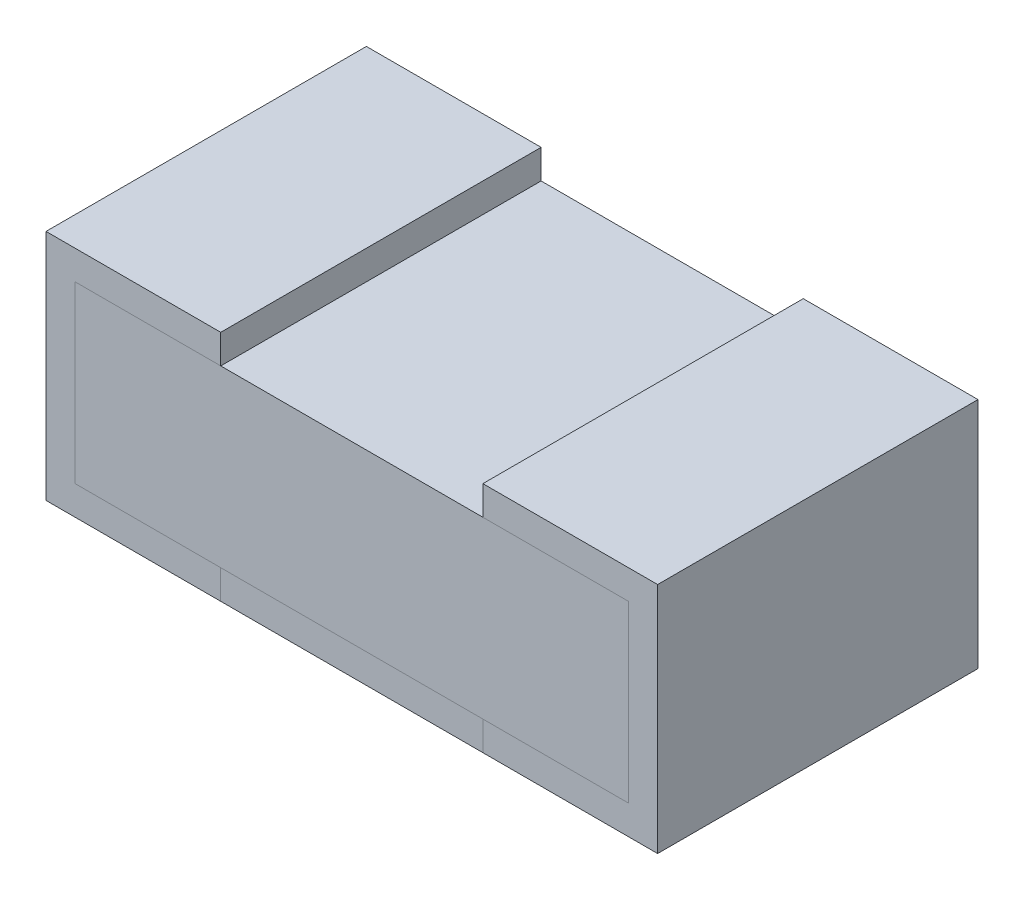
ISO-10303-21;
HEADER;
FILE_DESCRIPTION(('STEP AP214'),'2;1');
FILE_NAME('part.step','',(''),(''),'','','');
FILE_SCHEMA(('AUTOMOTIVE_DESIGN { 1 0 10303 214 1 1 1 1 }'));
ENDSEC;
DATA;
#1=APPLICATION_CONTEXT('core data for automotive mechanical design processes');
#2=APPLICATION_PROTOCOL_DEFINITION('international standard','automotive_design',2000,#1);
#3=PRODUCT_CONTEXT('',#1,'mechanical');
#4=PRODUCT('Part','Part','',(#3));
#5=PRODUCT_RELATED_PRODUCT_CATEGORY('part','',(#4));
#6=PRODUCT_DEFINITION_FORMATION('','',#4);
#7=PRODUCT_DEFINITION_CONTEXT('part definition',#1,'design');
#8=PRODUCT_DEFINITION('design','',#6,#7);
#9=PRODUCT_DEFINITION_SHAPE('','',#8);
#10=(LENGTH_UNIT() NAMED_UNIT(*) SI_UNIT(.MILLI.,.METRE.));
#11=(NAMED_UNIT(*) PLANE_ANGLE_UNIT() SI_UNIT($,.RADIAN.));
#12=(NAMED_UNIT(*) SI_UNIT($,.STERADIAN.) SOLID_ANGLE_UNIT());
#13=UNCERTAINTY_MEASURE_WITH_UNIT(LENGTH_MEASURE(1.E-05),#10,'distance_accuracy_value','');
#14=(GEOMETRIC_REPRESENTATION_CONTEXT(3) GLOBAL_UNCERTAINTY_ASSIGNED_CONTEXT((#13)) GLOBAL_UNIT_ASSIGNED_CONTEXT((#10,
#11,#12)) REPRESENTATION_CONTEXT('',''));
#15=CARTESIAN_POINT('',(0.,0.,0.));
#16=DIRECTION('',(0.,0.,1.));
#17=DIRECTION('',(1.,0.,0.));
#18=AXIS2_PLACEMENT_3D('',#15,#16,#17);
#19=CARTESIAN_POINT('',(0.749999999953739,0.,1.375));
#20=DIRECTION('',(-1.,0.,0.));
#21=DIRECTION('',(0.,0.,1.));
#22=AXIS2_PLACEMENT_3D('',#19,#20,#21);
#23=PLANE('',#22);
#24=DIRECTION('',(0.,1.,0.));
#25=VECTOR('',#24,1.);
#26=CARTESIAN_POINT('',(0.749999999953739,0.,0.));
#27=LINE('',#26,#25);
#28=CARTESIAN_POINT('',(0.749999999953739,0.,0.));
#29=VERTEX_POINT('',#28);
#30=CARTESIAN_POINT('',(0.749999999953739,0.124999999968622,0.));
#31=VERTEX_POINT('',#30);
#32=EDGE_CURVE('E145',#29,#31,#27,.T.);
#33=ORIENTED_EDGE('',*,*,#32,.T.);
#34=DIRECTION('',(0.,0.,-1.));
#35=VECTOR('',#34,1.);
#36=CARTESIAN_POINT('',(0.749999999953739,0.124999999968622,1.375));
#37=LINE('',#36,#35);
#38=CARTESIAN_POINT('',(0.749999999953739,0.124999999968622,1.375));
#39=VERTEX_POINT('',#38);
#40=EDGE_CURVE('E12',#39,#31,#37,.T.);
#41=ORIENTED_EDGE('',*,*,#40,.F.);
#42=DIRECTION('',(0.,1.,0.));
#43=VECTOR('',#42,1.);
#44=CARTESIAN_POINT('',(0.749999999953739,0.,1.375));
#45=LINE('',#44,#43);
#46=CARTESIAN_POINT('',(0.749999999953739,0.,1.375));
#47=VERTEX_POINT('',#46);
#48=EDGE_CURVE('E159',#47,#39,#45,.T.);
#49=ORIENTED_EDGE('',*,*,#48,.F.);
#50=DIRECTION('',(0.,0.,-1.));
#51=VECTOR('',#50,1.);
#52=CARTESIAN_POINT('',(0.749999999953739,0.,1.375));
#53=LINE('',#52,#51);
#54=EDGE_CURVE('E141',#47,#29,#53,.T.);
#55=ORIENTED_EDGE('',*,*,#54,.T.);
#56=EDGE_LOOP('',(#33,#41,#49,#55));
#57=FACE_BOUND('',#56,.T.);
#58=ADVANCED_FACE('F49',(#57),#23,.F.);
#59=CARTESIAN_POINT('',(0.749999999953739,0.124999999968622,1.375));
#60=DIRECTION('',(0.,-1.,0.));
#61=DIRECTION('',(0.,0.,-1.));
#62=AXIS2_PLACEMENT_3D('',#59,#60,#61);
#63=PLANE('',#62);
#64=DIRECTION('',(-1.,0.,0.));
#65=VECTOR('',#64,1.);
#66=CARTESIAN_POINT('',(0.749999999953739,0.124999999968622,0.));
#67=LINE('',#66,#65);
#68=CARTESIAN_POINT('',(0.124999999968484,0.124999999968622,0.));
#69=VERTEX_POINT('',#68);
#70=EDGE_CURVE('E148',#31,#69,#67,.T.);
#71=ORIENTED_EDGE('',*,*,#70,.T.);
#72=DIRECTION('',(0.,0.,-1.));
#73=VECTOR('',#72,1.);
#74=CARTESIAN_POINT('',(0.124999999968484,0.124999999968622,1.375));
#75=LINE('',#74,#73);
#76=CARTESIAN_POINT('',(0.124999999968484,0.124999999968622,1.375));
#77=VERTEX_POINT('',#76);
#78=EDGE_CURVE('E57',#77,#69,#75,.T.);
#79=ORIENTED_EDGE('',*,*,#78,.F.);
#80=DIRECTION('',(-1.,0.,0.));
#81=VECTOR('',#80,1.);
#82=CARTESIAN_POINT('',(0.749999999953739,0.124999999968622,1.375));
#83=LINE('',#82,#81);
#84=EDGE_CURVE('E108',#39,#77,#83,.T.);
#85=ORIENTED_EDGE('',*,*,#84,.F.);
#86=ORIENTED_EDGE('',*,*,#40,.T.);
#87=EDGE_LOOP('',(#71,#79,#85,#86));
#88=FACE_BOUND('',#87,.T.);
#89=ADVANCED_FACE('F194',(#88),#63,.F.);
#90=CARTESIAN_POINT('',(0.124999999968484,0.124999999968622,1.375));
#91=DIRECTION('',(-1.,0.,0.));
#92=DIRECTION('',(0.,0.,1.));
#93=AXIS2_PLACEMENT_3D('',#90,#91,#92);
#94=PLANE('',#93);
#95=DIRECTION('',(0.,1.,0.));
#96=VECTOR('',#95,1.);
#97=CARTESIAN_POINT('',(0.124999999968484,0.124999999968622,0.));
#98=LINE('',#97,#96);
#99=CARTESIAN_POINT('',(0.124999999968484,0.875000000098263,0.));
#100=VERTEX_POINT('',#99);
#101=EDGE_CURVE('E150',#69,#100,#98,.T.);
#102=ORIENTED_EDGE('',*,*,#101,.T.);
#103=DIRECTION('',(0.,0.,-1.));
#104=VECTOR('',#103,1.);
#105=CARTESIAN_POINT('',(0.124999999968484,0.875000000098263,1.375));
#106=LINE('',#105,#104);
#107=CARTESIAN_POINT('',(0.124999999968484,0.875000000098263,1.375));
#108=VERTEX_POINT('',#107);
#109=EDGE_CURVE('E166',#108,#100,#106,.T.);
#110=ORIENTED_EDGE('',*,*,#109,.F.);
#111=DIRECTION('',(0.,1.,0.));
#112=VECTOR('',#111,1.);
#113=CARTESIAN_POINT('',(0.124999999968484,0.124999999968622,1.375));
#114=LINE('',#113,#112);
#115=EDGE_CURVE('E174',#77,#108,#114,.T.);
#116=ORIENTED_EDGE('',*,*,#115,.F.);
#117=ORIENTED_EDGE('',*,*,#78,.T.);
#118=EDGE_LOOP('',(#102,#110,#116,#117));
#119=FACE_BOUND('',#118,.T.);
#120=ADVANCED_FACE('F172',(#119),#94,.F.);
#121=CARTESIAN_POINT('',(0.124999999968484,0.875000000098263,1.375));
#122=DIRECTION('',(0.,1.,0.));
#123=DIRECTION('',(0.,0.,1.));
#124=AXIS2_PLACEMENT_3D('',#121,#122,#123);
#125=PLANE('',#124);
#126=DIRECTION('',(1.,0.,0.));
#127=VECTOR('',#126,1.);
#128=CARTESIAN_POINT('',(0.124999999968484,0.875000000098263,0.));
#129=LINE('',#128,#127);
#130=CARTESIAN_POINT('',(0.749999999953739,0.875000000098263,0.));
#131=VERTEX_POINT('',#130);
#132=EDGE_CURVE('E152',#100,#131,#129,.T.);
#133=ORIENTED_EDGE('',*,*,#132,.T.);
#134=DIRECTION('',(0.,0.,-1.));
#135=VECTOR('',#134,1.);
#136=CARTESIAN_POINT('',(0.749999999953739,0.875000000098263,1.375));
#137=LINE('',#136,#135);
#138=CARTESIAN_POINT('',(0.749999999953739,0.875000000098263,1.375));
#139=VERTEX_POINT('',#138);
#140=EDGE_CURVE('E163',#139,#131,#137,.T.);
#141=ORIENTED_EDGE('',*,*,#140,.F.);
#142=DIRECTION('',(1.,0.,0.));
#143=VECTOR('',#142,1.);
#144=CARTESIAN_POINT('',(0.124999999968484,0.875000000098263,1.375));
#145=LINE('',#144,#143);
#146=EDGE_CURVE('E186',#108,#139,#145,.T.);
#147=ORIENTED_EDGE('',*,*,#146,.F.);
#148=ORIENTED_EDGE('',*,*,#109,.T.);
#149=EDGE_LOOP('',(#133,#141,#147,#148));
#150=FACE_BOUND('',#149,.T.);
#151=ADVANCED_FACE('F182',(#150),#125,.F.);
#152=CARTESIAN_POINT('',(0.749999999953739,0.875000000098263,1.375));
#153=DIRECTION('',(-1.,0.,0.));
#154=DIRECTION('',(0.,0.,1.));
#155=AXIS2_PLACEMENT_3D('',#152,#153,#154);
#156=PLANE('',#155);
#157=DIRECTION('',(0.,1.,0.));
#158=VECTOR('',#157,1.);
#159=CARTESIAN_POINT('',(0.749999999953739,0.875000000098263,0.));
#160=LINE('',#159,#158);
#161=CARTESIAN_POINT('',(0.749999999953739,1.0000000000332,0.));
#162=VERTEX_POINT('',#161);
#163=EDGE_CURVE('E154',#131,#162,#160,.T.);
#164=ORIENTED_EDGE('',*,*,#163,.T.);
#165=DIRECTION('',(0.,0.,-1.));
#166=VECTOR('',#165,1.);
#167=CARTESIAN_POINT('',(0.749999999953739,1.0000000000332,1.375));
#168=LINE('',#167,#166);
#169=CARTESIAN_POINT('',(0.749999999953739,1.0000000000332,1.375));
#170=VERTEX_POINT('',#169);
#171=EDGE_CURVE('E136',#170,#162,#168,.T.);
#172=ORIENTED_EDGE('',*,*,#171,.F.);
#173=DIRECTION('',(0.,1.,0.));
#174=VECTOR('',#173,1.);
#175=CARTESIAN_POINT('',(0.749999999953739,0.875000000098263,1.375));
#176=LINE('',#175,#174);
#177=EDGE_CURVE('E127',#139,#170,#176,.T.);
#178=ORIENTED_EDGE('',*,*,#177,.F.);
#179=ORIENTED_EDGE('',*,*,#140,.T.);
#180=EDGE_LOOP('',(#164,#172,#178,#179));
#181=FACE_BOUND('',#180,.T.);
#182=ADVANCED_FACE('F185',(#181),#156,.F.);
#183=CARTESIAN_POINT('',(0.749999999953739,1.0000000000332,1.375));
#184=DIRECTION('',(0.,-1.,0.));
#185=DIRECTION('',(0.,0.,-1.));
#186=AXIS2_PLACEMENT_3D('',#183,#184,#185);
#187=PLANE('',#186);
#188=DIRECTION('',(-1.,0.,0.));
#189=VECTOR('',#188,1.);
#190=CARTESIAN_POINT('',(0.749999999953739,1.0000000000332,0.));
#191=LINE('',#190,#189);
#192=CARTESIAN_POINT('',(0.,1.0000000000332,0.));
#193=VERTEX_POINT('',#192);
#194=EDGE_CURVE('E135',#162,#193,#191,.T.);
#195=ORIENTED_EDGE('',*,*,#194,.T.);
#196=DIRECTION('',(0.,0.,-1.));
#197=VECTOR('',#196,1.);
#198=CARTESIAN_POINT('',(0.,1.0000000000332,1.375));
#199=LINE('',#198,#197);
#200=CARTESIAN_POINT('',(0.,1.0000000000332,1.375));
#201=VERTEX_POINT('',#200);
#202=EDGE_CURVE('E132',#201,#193,#199,.T.);
#203=ORIENTED_EDGE('',*,*,#202,.F.);
#204=DIRECTION('',(-1.,0.,0.));
#205=VECTOR('',#204,1.);
#206=CARTESIAN_POINT('',(0.749999999953739,1.0000000000332,1.375));
#207=LINE('',#206,#205);
#208=EDGE_CURVE('E121',#170,#201,#207,.T.);
#209=ORIENTED_EDGE('',*,*,#208,.F.);
#210=ORIENTED_EDGE('',*,*,#171,.T.);
#211=EDGE_LOOP('',(#195,#203,#209,#210));
#212=FACE_BOUND('',#211,.T.);
#213=ADVANCED_FACE('F133',(#212),#187,.F.);
#214=CARTESIAN_POINT('',(0.,1.0000000000332,1.375));
#215=DIRECTION('',(1.,0.,0.));
#216=DIRECTION('',(0.,0.,-1.));
#217=AXIS2_PLACEMENT_3D('',#214,#215,#216);
#218=PLANE('',#217);
#219=DIRECTION('',(0.,-1.,0.));
#220=VECTOR('',#219,1.);
#221=CARTESIAN_POINT('',(0.,1.0000000000332,0.));
#222=LINE('',#221,#220);
#223=CARTESIAN_POINT('',(0.,0.,0.));
#224=VERTEX_POINT('',#223);
#225=EDGE_CURVE('E94',#193,#224,#222,.T.);
#226=ORIENTED_EDGE('',*,*,#225,.T.);
#227=DIRECTION('',(0.,0.,-1.));
#228=VECTOR('',#227,1.);
#229=CARTESIAN_POINT('',(0.,0.,1.375));
#230=LINE('',#229,#228);
#231=CARTESIAN_POINT('',(0.,0.,1.375));
#232=VERTEX_POINT('',#231);
#233=EDGE_CURVE('E137',#232,#224,#230,.T.);
#234=ORIENTED_EDGE('',*,*,#233,.F.);
#235=DIRECTION('',(0.,-1.,0.));
#236=VECTOR('',#235,1.);
#237=CARTESIAN_POINT('',(0.,1.0000000000332,1.375));
#238=LINE('',#237,#236);
#239=EDGE_CURVE('E125',#201,#232,#238,.T.);
#240=ORIENTED_EDGE('',*,*,#239,.F.);
#241=ORIENTED_EDGE('',*,*,#202,.T.);
#242=EDGE_LOOP('',(#226,#234,#240,#241));
#243=FACE_BOUND('',#242,.T.);
#244=ADVANCED_FACE('F139',(#243),#218,.F.);
#245=CARTESIAN_POINT('',(0.,0.,1.375));
#246=DIRECTION('',(0.,1.,0.));
#247=DIRECTION('',(0.,0.,1.));
#248=AXIS2_PLACEMENT_3D('',#245,#246,#247);
#249=PLANE('',#248);
#250=DIRECTION('',(1.,0.,0.));
#251=VECTOR('',#250,1.);
#252=CARTESIAN_POINT('',(0.,0.,0.));
#253=LINE('',#252,#251);
#254=EDGE_CURVE('E100',#224,#29,#253,.T.);
#255=ORIENTED_EDGE('',*,*,#254,.T.);
#256=ORIENTED_EDGE('',*,*,#54,.F.);
#257=DIRECTION('',(1.,0.,0.));
#258=VECTOR('',#257,1.);
#259=CARTESIAN_POINT('',(0.,0.,1.375));
#260=LINE('',#259,#258);
#261=EDGE_CURVE('E65',#232,#47,#260,.T.);
#262=ORIENTED_EDGE('',*,*,#261,.F.);
#263=ORIENTED_EDGE('',*,*,#233,.T.);
#264=EDGE_LOOP('',(#255,#256,#262,#263));
#265=FACE_BOUND('',#264,.T.);
#266=ADVANCED_FACE('F210',(#265),#249,.F.);
#267=CARTESIAN_POINT('',(0.,0.,1.375));
#268=DIRECTION('',(0.,0.,1.));
#269=DIRECTION('',(1.,0.,0.));
#270=AXIS2_PLACEMENT_3D('',#267,#268,#269);
#271=PLANE('',#270);
#272=ORIENTED_EDGE('',*,*,#48,.T.);
#273=ORIENTED_EDGE('',*,*,#84,.T.);
#274=ORIENTED_EDGE('',*,*,#115,.T.);
#275=ORIENTED_EDGE('',*,*,#146,.T.);
#276=ORIENTED_EDGE('',*,*,#177,.T.);
#277=ORIENTED_EDGE('',*,*,#208,.T.);
#278=ORIENTED_EDGE('',*,*,#239,.T.);
#279=ORIENTED_EDGE('',*,*,#261,.T.);
#280=EDGE_LOOP('',(#272,#273,#274,#275,#276,#277,#278,#279));
#281=FACE_BOUND('',#280,.T.);
#282=ADVANCED_FACE('F123',(#281),#271,.T.);
#283=CARTESIAN_POINT('',(0.,0.,0.));
#284=DIRECTION('',(0.,0.,1.));
#285=DIRECTION('',(1.,0.,0.));
#286=AXIS2_PLACEMENT_3D('',#283,#284,#285);
#287=PLANE('',#286);
#288=ORIENTED_EDGE('',*,*,#32,.F.);
#289=ORIENTED_EDGE('',*,*,#254,.F.);
#290=ORIENTED_EDGE('',*,*,#225,.F.);
#291=ORIENTED_EDGE('',*,*,#194,.F.);
#292=ORIENTED_EDGE('',*,*,#163,.F.);
#293=ORIENTED_EDGE('',*,*,#132,.F.);
#294=ORIENTED_EDGE('',*,*,#101,.F.);
#295=ORIENTED_EDGE('',*,*,#70,.F.);
#296=EDGE_LOOP('',(#288,#289,#290,#291,#292,#293,#294,#295));
#297=FACE_BOUND('',#296,.T.);
#298=ADVANCED_FACE('F178',(#297),#287,.F.);
#299=CLOSED_SHELL('',(#58,#89,#120,#151,#182,#213,#244,#266,#282,#298));
#300=MANIFOLD_SOLID_BREP('B2',#299);
#301=CARTESIAN_POINT('',(1.87499999995575,0.124999999968622,0.));
#302=DIRECTION('',(1.,0.,0.));
#303=DIRECTION('',(0.,0.,-1.));
#304=AXIS2_PLACEMENT_3D('',#301,#302,#303);
#305=PLANE('',#304);
#306=DIRECTION('',(0.,1.,0.));
#307=VECTOR('',#306,1.);
#308=CARTESIAN_POINT('',(1.87499999995575,0.124999999968622,1.375));
#309=LINE('',#308,#307);
#310=CARTESIAN_POINT('',(1.87499999995575,0.,1.375));
#311=VERTEX_POINT('',#310);
#312=CARTESIAN_POINT('',(1.87499999995575,0.124999999968622,1.375));
#313=VERTEX_POINT('',#312);
#314=EDGE_CURVE('E350',#311,#313,#309,.T.);
#315=ORIENTED_EDGE('',*,*,#314,.F.);
#316=DIRECTION('',(0.,0.,1.));
#317=VECTOR('',#316,1.);
#318=CARTESIAN_POINT('',(1.87499999995575,0.,0.));
#319=LINE('',#318,#317);
#320=CARTESIAN_POINT('',(1.87499999995575,0.,0.));
#321=VERTEX_POINT('',#320);
#322=EDGE_CURVE('E47',#321,#311,#319,.T.);
#323=ORIENTED_EDGE('',*,*,#322,.F.);
#324=DIRECTION('',(0.,1.,0.));
#325=VECTOR('',#324,1.);
#326=CARTESIAN_POINT('',(1.87499999995575,0.124999999968622,0.));
#327=LINE('',#326,#325);
#328=CARTESIAN_POINT('',(1.87499999995575,0.124999999968622,0.));
#329=VERTEX_POINT('',#328);
#330=EDGE_CURVE('E344',#321,#329,#327,.T.);
#331=ORIENTED_EDGE('',*,*,#330,.T.);
#332=DIRECTION('',(0.,0.,1.));
#333=VECTOR('',#332,1.);
#334=CARTESIAN_POINT('',(1.87499999995575,0.124999999968622,0.));
#335=LINE('',#334,#333);
#336=EDGE_CURVE('E289',#329,#313,#335,.T.);
#337=ORIENTED_EDGE('',*,*,#336,.T.);
#338=EDGE_LOOP('',(#315,#323,#331,#337));
#339=FACE_BOUND('',#338,.T.);
#340=ADVANCED_FACE('F286',(#339),#305,.T.);
#341=CARTESIAN_POINT('',(1.87499999995575,0.,0.));
#342=DIRECTION('',(0.,-1.,0.));
#343=DIRECTION('',(0.,0.,-1.));
#344=AXIS2_PLACEMENT_3D('',#341,#342,#343);
#345=PLANE('',#344);
#346=DIRECTION('',(1.,0.,0.));
#347=VECTOR('',#346,1.);
#348=CARTESIAN_POINT('',(1.87499999995575,0.,1.375));
#349=LINE('',#348,#347);
#350=CARTESIAN_POINT('',(0.749999999953739,0.,1.375));
#351=VERTEX_POINT('',#350);
#352=EDGE_CURVE('E346',#351,#311,#349,.T.);
#353=ORIENTED_EDGE('',*,*,#352,.F.);
#354=DIRECTION('',(0.,0.,1.));
#355=VECTOR('',#354,1.);
#356=CARTESIAN_POINT('',(0.749999999953739,0.,0.));
#357=LINE('',#356,#355);
#358=CARTESIAN_POINT('',(0.749999999953739,0.,0.));
#359=VERTEX_POINT('',#358);
#360=EDGE_CURVE('E295',#359,#351,#357,.T.);
#361=ORIENTED_EDGE('',*,*,#360,.F.);
#362=DIRECTION('',(1.,0.,0.));
#363=VECTOR('',#362,1.);
#364=CARTESIAN_POINT('',(1.87499999995575,0.,0.));
#365=LINE('',#364,#363);
#366=EDGE_CURVE('E341',#359,#321,#365,.T.);
#367=ORIENTED_EDGE('',*,*,#366,.T.);
#368=ORIENTED_EDGE('',*,*,#322,.T.);
#369=EDGE_LOOP('',(#353,#361,#367,#368));
#370=FACE_BOUND('',#369,.T.);
#371=ADVANCED_FACE('F360',(#370),#345,.T.);
#372=CARTESIAN_POINT('',(0.749999999953739,0.,0.));
#373=DIRECTION('',(-1.,0.,0.));
#374=DIRECTION('',(0.,0.,1.));
#375=AXIS2_PLACEMENT_3D('',#372,#373,#374);
#376=PLANE('',#375);
#377=DIRECTION('',(0.,-1.,0.));
#378=VECTOR('',#377,1.);
#379=CARTESIAN_POINT('',(0.749999999953739,0.,1.375));
#380=LINE('',#379,#378);
#381=CARTESIAN_POINT('',(0.749999999953739,0.124999999968622,1.375));
#382=VERTEX_POINT('',#381);
#383=EDGE_CURVE('E336',#382,#351,#380,.T.);
#384=ORIENTED_EDGE('',*,*,#383,.F.);
#385=DIRECTION('',(0.,0.,1.));
#386=VECTOR('',#385,1.);
#387=CARTESIAN_POINT('',(0.749999999953739,0.124999999968622,0.));
#388=LINE('',#387,#386);
#389=CARTESIAN_POINT('',(0.749999999953739,0.124999999968622,0.));
#390=VERTEX_POINT('',#389);
#391=EDGE_CURVE('E331',#390,#382,#388,.T.);
#392=ORIENTED_EDGE('',*,*,#391,.F.);
#393=DIRECTION('',(0.,-1.,0.));
#394=VECTOR('',#393,1.);
#395=CARTESIAN_POINT('',(0.749999999953739,0.,0.));
#396=LINE('',#395,#394);
#397=EDGE_CURVE('E334',#390,#359,#396,.T.);
#398=ORIENTED_EDGE('',*,*,#397,.T.);
#399=ORIENTED_EDGE('',*,*,#360,.T.);
#400=EDGE_LOOP('',(#384,#392,#398,#399));
#401=FACE_BOUND('',#400,.T.);
#402=ADVANCED_FACE('F333',(#401),#376,.T.);
#403=CARTESIAN_POINT('',(0.749999999953739,0.124999999968622,0.));
#404=DIRECTION('',(0.,1.,0.));
#405=DIRECTION('',(0.,0.,1.));
#406=AXIS2_PLACEMENT_3D('',#403,#404,#405);
#407=PLANE('',#406);
#408=DIRECTION('',(-1.,0.,0.));
#409=VECTOR('',#408,1.);
#410=CARTESIAN_POINT('',(0.749999999953739,0.124999999968622,1.375));
#411=LINE('',#410,#409);
#412=EDGE_CURVE('E353',#313,#382,#411,.T.);
#413=ORIENTED_EDGE('',*,*,#412,.F.);
#414=ORIENTED_EDGE('',*,*,#336,.F.);
#415=DIRECTION('',(-1.,0.,0.));
#416=VECTOR('',#415,1.);
#417=CARTESIAN_POINT('',(0.749999999953739,0.124999999968622,0.));
#418=LINE('',#417,#416);
#419=EDGE_CURVE('E340',#329,#390,#418,.T.);
#420=ORIENTED_EDGE('',*,*,#419,.T.);
#421=ORIENTED_EDGE('',*,*,#391,.T.);
#422=EDGE_LOOP('',(#413,#414,#420,#421));
#423=FACE_BOUND('',#422,.T.);
#424=ADVANCED_FACE('F343',(#423),#407,.T.);
#425=CARTESIAN_POINT('',(0.,0.,0.));
#426=DIRECTION('',(0.,0.,-1.));
#427=DIRECTION('',(-1.,0.,0.));
#428=AXIS2_PLACEMENT_3D('',#425,#426,#427);
#429=PLANE('',#428);
#430=ORIENTED_EDGE('',*,*,#330,.F.);
#431=ORIENTED_EDGE('',*,*,#366,.F.);
#432=ORIENTED_EDGE('',*,*,#397,.F.);
#433=ORIENTED_EDGE('',*,*,#419,.F.);
#434=EDGE_LOOP('',(#430,#431,#432,#433));
#435=FACE_BOUND('',#434,.T.);
#436=ADVANCED_FACE('F339',(#435),#429,.T.);
#437=CARTESIAN_POINT('',(0.,0.,1.375));
#438=DIRECTION('',(0.,0.,-1.));
#439=DIRECTION('',(-1.,0.,0.));
#440=AXIS2_PLACEMENT_3D('',#437,#438,#439);
#441=PLANE('',#440);
#442=ORIENTED_EDGE('',*,*,#314,.T.);
#443=ORIENTED_EDGE('',*,*,#412,.T.);
#444=ORIENTED_EDGE('',*,*,#383,.T.);
#445=ORIENTED_EDGE('',*,*,#352,.T.);
#446=EDGE_LOOP('',(#442,#443,#444,#445));
#447=FACE_BOUND('',#446,.T.);
#448=ADVANCED_FACE('F359',(#447),#441,.F.);
#449=CLOSED_SHELL('',(#340,#371,#402,#424,#436,#448));
#450=MANIFOLD_SOLID_BREP('B6',#449);
#451=CARTESIAN_POINT('',(2.49999999994099,0.875000000131951,0.));
#452=DIRECTION('',(1.,0.,0.));
#453=DIRECTION('',(0.,0.,-1.));
#454=AXIS2_PLACEMENT_3D('',#451,#452,#453);
#455=PLANE('',#454);
#456=DIRECTION('',(0.,1.,0.));
#457=VECTOR('',#456,1.);
#458=CARTESIAN_POINT('',(2.49999999994099,0.875000000131951,1.375));
#459=LINE('',#458,#457);
#460=CARTESIAN_POINT('',(2.49999999994099,0.124999999968622,1.375));
#461=VERTEX_POINT('',#460);
#462=CARTESIAN_POINT('',(2.49999999994099,0.875000000131951,1.375));
#463=VERTEX_POINT('',#462);
#464=EDGE_CURVE('E482',#461,#463,#459,.T.);
#465=ORIENTED_EDGE('',*,*,#464,.F.);
#466=DIRECTION('',(0.,0.,1.));
#467=VECTOR('',#466,1.);
#468=CARTESIAN_POINT('',(2.49999999994099,0.124999999968622,0.));
#469=LINE('',#468,#467);
#470=CARTESIAN_POINT('',(2.49999999994099,0.124999999968622,0.));
#471=VERTEX_POINT('',#470);
#472=EDGE_CURVE('E284',#471,#461,#469,.T.);
#473=ORIENTED_EDGE('',*,*,#472,.F.);
#474=DIRECTION('',(0.,1.,0.));
#475=VECTOR('',#474,1.);
#476=CARTESIAN_POINT('',(2.49999999994099,0.875000000131951,0.));
#477=LINE('',#476,#475);
#478=CARTESIAN_POINT('',(2.49999999994099,0.875000000131951,0.));
#479=VERTEX_POINT('',#478);
#480=EDGE_CURVE('E476',#471,#479,#477,.T.);
#481=ORIENTED_EDGE('',*,*,#480,.T.);
#482=DIRECTION('',(0.,0.,1.));
#483=VECTOR('',#482,1.);
#484=CARTESIAN_POINT('',(2.49999999994099,0.875000000131951,0.));
#485=LINE('',#484,#483);
#486=EDGE_CURVE('E421',#479,#463,#485,.T.);
#487=ORIENTED_EDGE('',*,*,#486,.T.);
#488=EDGE_LOOP('',(#465,#473,#481,#487));
#489=FACE_BOUND('',#488,.T.);
#490=ADVANCED_FACE('F418',(#489),#455,.T.);
#491=CARTESIAN_POINT('',(2.49999999994099,0.124999999968622,0.));
#492=DIRECTION('',(0.,-1.,0.));
#493=DIRECTION('',(0.,0.,-1.));
#494=AXIS2_PLACEMENT_3D('',#491,#492,#493);
#495=PLANE('',#494);
#496=DIRECTION('',(1.,0.,0.));
#497=VECTOR('',#496,1.);
#498=CARTESIAN_POINT('',(2.49999999994099,0.124999999968622,1.375));
#499=LINE('',#498,#497);
#500=CARTESIAN_POINT('',(0.124999999968484,0.124999999968622,1.375));
#501=VERTEX_POINT('',#500);
#502=EDGE_CURVE('E478',#501,#461,#499,.T.);
#503=ORIENTED_EDGE('',*,*,#502,.F.);
#504=DIRECTION('',(0.,0.,1.));
#505=VECTOR('',#504,1.);
#506=CARTESIAN_POINT('',(0.124999999968484,0.124999999968622,0.));
#507=LINE('',#506,#505);
#508=CARTESIAN_POINT('',(0.124999999968484,0.124999999968622,0.));
#509=VERTEX_POINT('',#508);
#510=EDGE_CURVE('E427',#509,#501,#507,.T.);
#511=ORIENTED_EDGE('',*,*,#510,.F.);
#512=DIRECTION('',(1.,0.,0.));
#513=VECTOR('',#512,1.);
#514=CARTESIAN_POINT('',(2.49999999994099,0.124999999968622,0.));
#515=LINE('',#514,#513);
#516=EDGE_CURVE('E473',#509,#471,#515,.T.);
#517=ORIENTED_EDGE('',*,*,#516,.T.);
#518=ORIENTED_EDGE('',*,*,#472,.T.);
#519=EDGE_LOOP('',(#503,#511,#517,#518));
#520=FACE_BOUND('',#519,.T.);
#521=ADVANCED_FACE('F492',(#520),#495,.T.);
#522=CARTESIAN_POINT('',(0.124999999968484,0.124999999968622,0.));
#523=DIRECTION('',(-1.,0.,0.));
#524=DIRECTION('',(0.,0.,1.));
#525=AXIS2_PLACEMENT_3D('',#522,#523,#524);
#526=PLANE('',#525);
#527=DIRECTION('',(0.,-1.,0.));
#528=VECTOR('',#527,1.);
#529=CARTESIAN_POINT('',(0.124999999968484,0.124999999968622,1.375));
#530=LINE('',#529,#528);
#531=CARTESIAN_POINT('',(0.124999999968484,0.875000000098263,1.375));
#532=VERTEX_POINT('',#531);
#533=EDGE_CURVE('E468',#532,#501,#530,.T.);
#534=ORIENTED_EDGE('',*,*,#533,.F.);
#535=DIRECTION('',(0.,0.,1.));
#536=VECTOR('',#535,1.);
#537=CARTESIAN_POINT('',(0.124999999968484,0.875000000098263,0.));
#538=LINE('',#537,#536);
#539=CARTESIAN_POINT('',(0.124999999968484,0.875000000098263,0.));
#540=VERTEX_POINT('',#539);
#541=EDGE_CURVE('E463',#540,#532,#538,.T.);
#542=ORIENTED_EDGE('',*,*,#541,.F.);
#543=DIRECTION('',(0.,-1.,0.));
#544=VECTOR('',#543,1.);
#545=CARTESIAN_POINT('',(0.124999999968484,0.124999999968622,0.));
#546=LINE('',#545,#544);
#547=EDGE_CURVE('E466',#540,#509,#546,.T.);
#548=ORIENTED_EDGE('',*,*,#547,.T.);
#549=ORIENTED_EDGE('',*,*,#510,.T.);
#550=EDGE_LOOP('',(#534,#542,#548,#549));
#551=FACE_BOUND('',#550,.T.);
#552=ADVANCED_FACE('F465',(#551),#526,.T.);
#553=CARTESIAN_POINT('',(0.124999999968484,0.875000000098263,0.));
#554=DIRECTION('',(-1.41845599595198E-11,1.,0.));
#555=DIRECTION('',(-1.,-1.41845599595198E-11,0.));
#556=AXIS2_PLACEMENT_3D('',#553,#554,#555);
#557=PLANE('',#556);
#558=DIRECTION('',(-1.,-1.41845599595198E-11,0.));
#559=VECTOR('',#558,1.);
#560=CARTESIAN_POINT('',(0.124999999968484,0.875000000098263,1.375));
#561=LINE('',#560,#559);
#562=EDGE_CURVE('E485',#463,#532,#561,.T.);
#563=ORIENTED_EDGE('',*,*,#562,.F.);
#564=ORIENTED_EDGE('',*,*,#486,.F.);
#565=DIRECTION('',(-1.,-1.41845599595198E-11,0.));
#566=VECTOR('',#565,1.);
#567=CARTESIAN_POINT('',(0.124999999968484,0.875000000098263,0.));
#568=LINE('',#567,#566);
#569=EDGE_CURVE('E472',#479,#540,#568,.T.);
#570=ORIENTED_EDGE('',*,*,#569,.T.);
#571=ORIENTED_EDGE('',*,*,#541,.T.);
#572=EDGE_LOOP('',(#563,#564,#570,#571));
#573=FACE_BOUND('',#572,.T.);
#574=ADVANCED_FACE('F475',(#573),#557,.T.);
#575=CARTESIAN_POINT('',(0.,0.,0.));
#576=DIRECTION('',(0.,0.,-1.));
#577=DIRECTION('',(-1.,0.,0.));
#578=AXIS2_PLACEMENT_3D('',#575,#576,#577);
#579=PLANE('',#578);
#580=ORIENTED_EDGE('',*,*,#480,.F.);
#581=ORIENTED_EDGE('',*,*,#516,.F.);
#582=ORIENTED_EDGE('',*,*,#547,.F.);
#583=ORIENTED_EDGE('',*,*,#569,.F.);
#584=EDGE_LOOP('',(#580,#581,#582,#583));
#585=FACE_BOUND('',#584,.T.);
#586=ADVANCED_FACE('F471',(#585),#579,.T.);
#587=CARTESIAN_POINT('',(0.,0.,1.375));
#588=DIRECTION('',(0.,0.,-1.));
#589=DIRECTION('',(-1.,0.,0.));
#590=AXIS2_PLACEMENT_3D('',#587,#588,#589);
#591=PLANE('',#590);
#592=ORIENTED_EDGE('',*,*,#464,.T.);
#593=ORIENTED_EDGE('',*,*,#562,.T.);
#594=ORIENTED_EDGE('',*,*,#533,.T.);
#595=ORIENTED_EDGE('',*,*,#502,.T.);
#596=EDGE_LOOP('',(#592,#593,#594,#595));
#597=FACE_BOUND('',#596,.T.);
#598=ADVANCED_FACE('F491',(#597),#591,.F.);
#599=CLOSED_SHELL('',(#490,#521,#552,#574,#586,#598));
#600=MANIFOLD_SOLID_BREP('B41',#599);
#601=CARTESIAN_POINT('',(1.87499999995575,1.00000000010057,1.375));
#602=DIRECTION('',(1.,0.,0.));
#603=DIRECTION('',(0.,0.,-1.));
#604=AXIS2_PLACEMENT_3D('',#601,#602,#603);
#605=PLANE('',#604);
#606=DIRECTION('',(0.,-1.,0.));
#607=VECTOR('',#606,1.);
#608=CARTESIAN_POINT('',(1.87499999995575,1.00000000010057,0.));
#609=LINE('',#608,#607);
#610=CARTESIAN_POINT('',(1.87499999995575,1.00000000010057,0.));
#611=VERTEX_POINT('',#610);
#612=CARTESIAN_POINT('',(1.87499999995575,0.875000000131951,0.));
#613=VERTEX_POINT('',#612);
#614=EDGE_CURVE('E637',#611,#613,#609,.T.);
#615=ORIENTED_EDGE('',*,*,#614,.T.);
#616=DIRECTION('',(0.,0.,-1.));
#617=VECTOR('',#616,1.);
#618=CARTESIAN_POINT('',(1.87499999995575,0.875000000131951,1.375));
#619=LINE('',#618,#617);
#620=CARTESIAN_POINT('',(1.87499999995575,0.875000000131951,1.375));
#621=VERTEX_POINT('',#620);
#622=EDGE_CURVE('E416',#621,#613,#619,.T.);
#623=ORIENTED_EDGE('',*,*,#622,.F.);
#624=DIRECTION('',(0.,-1.,0.));
#625=VECTOR('',#624,1.);
#626=CARTESIAN_POINT('',(1.87499999995575,1.00000000010057,1.375));
#627=LINE('',#626,#625);
#628=CARTESIAN_POINT('',(1.87499999995575,1.00000000010057,1.375));
#629=VERTEX_POINT('',#628);
#630=EDGE_CURVE('E651',#629,#621,#627,.T.);
#631=ORIENTED_EDGE('',*,*,#630,.F.);
#632=DIRECTION('',(0.,0.,-1.));
#633=VECTOR('',#632,1.);
#634=CARTESIAN_POINT('',(1.87499999995575,1.00000000010057,1.375));
#635=LINE('',#634,#633);
#636=EDGE_CURVE('E633',#629,#611,#635,.T.);
#637=ORIENTED_EDGE('',*,*,#636,.T.);
#638=EDGE_LOOP('',(#615,#623,#631,#637));
#639=FACE_BOUND('',#638,.T.);
#640=ADVANCED_FACE('F541',(#639),#605,.F.);
#641=CARTESIAN_POINT('',(1.87499999995575,0.875000000131951,1.375));
#642=DIRECTION('',(0.,1.,0.));
#643=DIRECTION('',(0.,0.,1.));
#644=AXIS2_PLACEMENT_3D('',#641,#642,#643);
#645=PLANE('',#644);
#646=DIRECTION('',(1.,0.,0.));
#647=VECTOR('',#646,1.);
#648=CARTESIAN_POINT('',(1.87499999995575,0.875000000131951,0.));
#649=LINE('',#648,#647);
#650=CARTESIAN_POINT('',(2.49999999994099,0.875000000131951,0.));
#651=VERTEX_POINT('',#650);
#652=EDGE_CURVE('E640',#613,#651,#649,.T.);
#653=ORIENTED_EDGE('',*,*,#652,.T.);
#654=DIRECTION('',(0.,0.,-1.));
#655=VECTOR('',#654,1.);
#656=CARTESIAN_POINT('',(2.49999999994099,0.875000000131951,1.375));
#657=LINE('',#656,#655);
#658=CARTESIAN_POINT('',(2.49999999994099,0.875000000131951,1.375));
#659=VERTEX_POINT('',#658);
#660=EDGE_CURVE('E549',#659,#651,#657,.T.);
#661=ORIENTED_EDGE('',*,*,#660,.F.);
#662=DIRECTION('',(1.,0.,0.));
#663=VECTOR('',#662,1.);
#664=CARTESIAN_POINT('',(1.87499999995575,0.875000000131951,1.375));
#665=LINE('',#664,#663);
#666=EDGE_CURVE('E600',#621,#659,#665,.T.);
#667=ORIENTED_EDGE('',*,*,#666,.F.);
#668=ORIENTED_EDGE('',*,*,#622,.T.);
#669=EDGE_LOOP('',(#653,#661,#667,#668));
#670=FACE_BOUND('',#669,.T.);
#671=ADVANCED_FACE('F686',(#670),#645,.F.);
#672=CARTESIAN_POINT('',(2.49999999994099,0.875000000131951,1.375));
#673=DIRECTION('',(1.,0.,0.));
#674=DIRECTION('',(0.,0.,-1.));
#675=AXIS2_PLACEMENT_3D('',#672,#673,#674);
#676=PLANE('',#675);
#677=DIRECTION('',(0.,-1.,0.));
#678=VECTOR('',#677,1.);
#679=CARTESIAN_POINT('',(2.49999999994099,0.875000000131951,0.));
#680=LINE('',#679,#678);
#681=CARTESIAN_POINT('',(2.49999999994099,0.124999999968622,0.));
#682=VERTEX_POINT('',#681);
#683=EDGE_CURVE('E642',#651,#682,#680,.T.);
#684=ORIENTED_EDGE('',*,*,#683,.T.);
#685=DIRECTION('',(0.,0.,-1.));
#686=VECTOR('',#685,1.);
#687=CARTESIAN_POINT('',(2.49999999994099,0.124999999968622,1.375));
#688=LINE('',#687,#686);
#689=CARTESIAN_POINT('',(2.49999999994099,0.124999999968622,1.375));
#690=VERTEX_POINT('',#689);
#691=EDGE_CURVE('E658',#690,#682,#688,.T.);
#692=ORIENTED_EDGE('',*,*,#691,.F.);
#693=DIRECTION('',(0.,-1.,0.));
#694=VECTOR('',#693,1.);
#695=CARTESIAN_POINT('',(2.49999999994099,0.875000000131951,1.375));
#696=LINE('',#695,#694);
#697=EDGE_CURVE('E666',#659,#690,#696,.T.);
#698=ORIENTED_EDGE('',*,*,#697,.F.);
#699=ORIENTED_EDGE('',*,*,#660,.T.);
#700=EDGE_LOOP('',(#684,#692,#698,#699));
#701=FACE_BOUND('',#700,.T.);
#702=ADVANCED_FACE('F664',(#701),#676,.F.);
#703=CARTESIAN_POINT('',(2.49999999994099,0.124999999968622,1.375));
#704=DIRECTION('',(0.,-1.,0.));
#705=DIRECTION('',(0.,0.,-1.));
#706=AXIS2_PLACEMENT_3D('',#703,#704,#705);
#707=PLANE('',#706);
#708=DIRECTION('',(-1.,0.,0.));
#709=VECTOR('',#708,1.);
#710=CARTESIAN_POINT('',(2.49999999994099,0.124999999968622,0.));
#711=LINE('',#710,#709);
#712=CARTESIAN_POINT('',(1.87499999995575,0.124999999968622,0.));
#713=VERTEX_POINT('',#712);
#714=EDGE_CURVE('E644',#682,#713,#711,.T.);
#715=ORIENTED_EDGE('',*,*,#714,.T.);
#716=DIRECTION('',(0.,0.,-1.));
#717=VECTOR('',#716,1.);
#718=CARTESIAN_POINT('',(1.87499999995575,0.124999999968622,1.375));
#719=LINE('',#718,#717);
#720=CARTESIAN_POINT('',(1.87499999995575,0.124999999968622,1.375));
#721=VERTEX_POINT('',#720);
#722=EDGE_CURVE('E655',#721,#713,#719,.T.);
#723=ORIENTED_EDGE('',*,*,#722,.F.);
#724=DIRECTION('',(-1.,0.,0.));
#725=VECTOR('',#724,1.);
#726=CARTESIAN_POINT('',(2.49999999994099,0.124999999968622,1.375));
#727=LINE('',#726,#725);
#728=EDGE_CURVE('E678',#690,#721,#727,.T.);
#729=ORIENTED_EDGE('',*,*,#728,.F.);
#730=ORIENTED_EDGE('',*,*,#691,.T.);
#731=EDGE_LOOP('',(#715,#723,#729,#730));
#732=FACE_BOUND('',#731,.T.);
#733=ADVANCED_FACE('F674',(#732),#707,.F.);
#734=CARTESIAN_POINT('',(1.87499999995575,0.124999999968622,1.375));
#735=DIRECTION('',(1.,0.,0.));
#736=DIRECTION('',(0.,0.,-1.));
#737=AXIS2_PLACEMENT_3D('',#734,#735,#736);
#738=PLANE('',#737);
#739=DIRECTION('',(0.,-1.,0.));
#740=VECTOR('',#739,1.);
#741=CARTESIAN_POINT('',(1.87499999995575,0.124999999968622,0.));
#742=LINE('',#741,#740);
#743=CARTESIAN_POINT('',(1.87499999995575,0.,0.));
#744=VERTEX_POINT('',#743);
#745=EDGE_CURVE('E646',#713,#744,#742,.T.);
#746=ORIENTED_EDGE('',*,*,#745,.T.);
#747=DIRECTION('',(0.,0.,-1.));
#748=VECTOR('',#747,1.);
#749=CARTESIAN_POINT('',(1.87499999995575,0.,1.375));
#750=LINE('',#749,#748);
#751=CARTESIAN_POINT('',(1.87499999995575,0.,1.375));
#752=VERTEX_POINT('',#751);
#753=EDGE_CURVE('E628',#752,#744,#750,.T.);
#754=ORIENTED_EDGE('',*,*,#753,.F.);
#755=DIRECTION('',(0.,-1.,0.));
#756=VECTOR('',#755,1.);
#757=CARTESIAN_POINT('',(1.87499999995575,0.124999999968622,1.375));
#758=LINE('',#757,#756);
#759=EDGE_CURVE('E619',#721,#752,#758,.T.);
#760=ORIENTED_EDGE('',*,*,#759,.F.);
#761=ORIENTED_EDGE('',*,*,#722,.T.);
#762=EDGE_LOOP('',(#746,#754,#760,#761));
#763=FACE_BOUND('',#762,.T.);
#764=ADVANCED_FACE('F677',(#763),#738,.F.);
#765=CARTESIAN_POINT('',(1.87499999995575,0.,1.375));
#766=DIRECTION('',(0.,1.,0.));
#767=DIRECTION('',(0.,0.,1.));
#768=AXIS2_PLACEMENT_3D('',#765,#766,#767);
#769=PLANE('',#768);
#770=DIRECTION('',(1.,0.,0.));
#771=VECTOR('',#770,1.);
#772=CARTESIAN_POINT('',(1.87499999995575,0.,0.));
#773=LINE('',#772,#771);
#774=CARTESIAN_POINT('',(2.62499999990949,0.,0.));
#775=VERTEX_POINT('',#774);
#776=EDGE_CURVE('E627',#744,#775,#773,.T.);
#777=ORIENTED_EDGE('',*,*,#776,.T.);
#778=DIRECTION('',(0.,0.,-1.));
#779=VECTOR('',#778,1.);
#780=CARTESIAN_POINT('',(2.62499999990949,0.,1.375));
#781=LINE('',#780,#779);
#782=CARTESIAN_POINT('',(2.62499999990949,0.,1.375));
#783=VERTEX_POINT('',#782);
#784=EDGE_CURVE('E624',#783,#775,#781,.T.);
#785=ORIENTED_EDGE('',*,*,#784,.F.);
#786=DIRECTION('',(1.,0.,0.));
#787=VECTOR('',#786,1.);
#788=CARTESIAN_POINT('',(1.87499999995575,0.,1.375));
#789=LINE('',#788,#787);
#790=EDGE_CURVE('E613',#752,#783,#789,.T.);
#791=ORIENTED_EDGE('',*,*,#790,.F.);
#792=ORIENTED_EDGE('',*,*,#753,.T.);
#793=EDGE_LOOP('',(#777,#785,#791,#792));
#794=FACE_BOUND('',#793,.T.);
#795=ADVANCED_FACE('F625',(#794),#769,.F.);
#796=CARTESIAN_POINT('',(2.62499999990949,0.,1.375));
#797=DIRECTION('',(-1.,0.,0.));
#798=DIRECTION('',(0.,0.,1.));
#799=AXIS2_PLACEMENT_3D('',#796,#797,#798);
#800=PLANE('',#799);
#801=DIRECTION('',(0.,1.,0.));
#802=VECTOR('',#801,1.);
#803=CARTESIAN_POINT('',(2.62499999990949,0.,0.));
#804=LINE('',#803,#802);
#805=CARTESIAN_POINT('',(2.62499999990949,1.00000000010057,0.));
#806=VERTEX_POINT('',#805);
#807=EDGE_CURVE('E586',#775,#806,#804,.T.);
#808=ORIENTED_EDGE('',*,*,#807,.T.);
#809=DIRECTION('',(0.,0.,-1.));
#810=VECTOR('',#809,1.);
#811=CARTESIAN_POINT('',(2.62499999990949,1.00000000010057,1.375));
#812=LINE('',#811,#810);
#813=CARTESIAN_POINT('',(2.62499999990949,1.00000000010057,1.375));
#814=VERTEX_POINT('',#813);
#815=EDGE_CURVE('E629',#814,#806,#812,.T.);
#816=ORIENTED_EDGE('',*,*,#815,.F.);
#817=DIRECTION('',(0.,1.,0.));
#818=VECTOR('',#817,1.);
#819=CARTESIAN_POINT('',(2.62499999990949,0.,1.375));
#820=LINE('',#819,#818);
#821=EDGE_CURVE('E617',#783,#814,#820,.T.);
#822=ORIENTED_EDGE('',*,*,#821,.F.);
#823=ORIENTED_EDGE('',*,*,#784,.T.);
#824=EDGE_LOOP('',(#808,#816,#822,#823));
#825=FACE_BOUND('',#824,.T.);
#826=ADVANCED_FACE('F631',(#825),#800,.F.);
#827=CARTESIAN_POINT('',(2.62499999990949,1.00000000010057,1.375));
#828=DIRECTION('',(0.,-1.,0.));
#829=DIRECTION('',(0.,0.,-1.));
#830=AXIS2_PLACEMENT_3D('',#827,#828,#829);
#831=PLANE('',#830);
#832=DIRECTION('',(-1.,0.,0.));
#833=VECTOR('',#832,1.);
#834=CARTESIAN_POINT('',(2.62499999990949,1.00000000010057,0.));
#835=LINE('',#834,#833);
#836=EDGE_CURVE('E592',#806,#611,#835,.T.);
#837=ORIENTED_EDGE('',*,*,#836,.T.);
#838=ORIENTED_EDGE('',*,*,#636,.F.);
#839=DIRECTION('',(-1.,0.,0.));
#840=VECTOR('',#839,1.);
#841=CARTESIAN_POINT('',(2.62499999990949,1.00000000010057,1.375));
#842=LINE('',#841,#840);
#843=EDGE_CURVE('E557',#814,#629,#842,.T.);
#844=ORIENTED_EDGE('',*,*,#843,.F.);
#845=ORIENTED_EDGE('',*,*,#815,.T.);
#846=EDGE_LOOP('',(#837,#838,#844,#845));
#847=FACE_BOUND('',#846,.T.);
#848=ADVANCED_FACE('F702',(#847),#831,.F.);
#849=CARTESIAN_POINT('',(0.,0.,1.375));
#850=DIRECTION('',(0.,0.,1.));
#851=DIRECTION('',(1.,0.,0.));
#852=AXIS2_PLACEMENT_3D('',#849,#850,#851);
#853=PLANE('',#852);
#854=ORIENTED_EDGE('',*,*,#630,.T.);
#855=ORIENTED_EDGE('',*,*,#666,.T.);
#856=ORIENTED_EDGE('',*,*,#697,.T.);
#857=ORIENTED_EDGE('',*,*,#728,.T.);
#858=ORIENTED_EDGE('',*,*,#759,.T.);
#859=ORIENTED_EDGE('',*,*,#790,.T.);
#860=ORIENTED_EDGE('',*,*,#821,.T.);
#861=ORIENTED_EDGE('',*,*,#843,.T.);
#862=EDGE_LOOP('',(#854,#855,#856,#857,#858,#859,#860,#861));
#863=FACE_BOUND('',#862,.T.);
#864=ADVANCED_FACE('F615',(#863),#853,.T.);
#865=CARTESIAN_POINT('',(0.,0.,0.));
#866=DIRECTION('',(0.,0.,1.));
#867=DIRECTION('',(1.,0.,0.));
#868=AXIS2_PLACEMENT_3D('',#865,#866,#867);
#869=PLANE('',#868);
#870=ORIENTED_EDGE('',*,*,#614,.F.);
#871=ORIENTED_EDGE('',*,*,#836,.F.);
#872=ORIENTED_EDGE('',*,*,#807,.F.);
#873=ORIENTED_EDGE('',*,*,#776,.F.);
#874=ORIENTED_EDGE('',*,*,#745,.F.);
#875=ORIENTED_EDGE('',*,*,#714,.F.);
#876=ORIENTED_EDGE('',*,*,#683,.F.);
#877=ORIENTED_EDGE('',*,*,#652,.F.);
#878=EDGE_LOOP('',(#870,#871,#872,#873,#874,#875,#876,#877));
#879=FACE_BOUND('',#878,.T.);
#880=ADVANCED_FACE('F670',(#879),#869,.F.);
#881=CLOSED_SHELL('',(#640,#671,#702,#733,#764,#795,#826,#848,#864,#880));
#882=MANIFOLD_SOLID_BREP('B278',#881);
#883=ADVANCED_BREP_SHAPE_REPRESENTATION('',(#18,#300,#450,#600,#882),#14);
#884=SHAPE_DEFINITION_REPRESENTATION(#9,#883);
ENDSEC;
END-ISO-10303-21;
